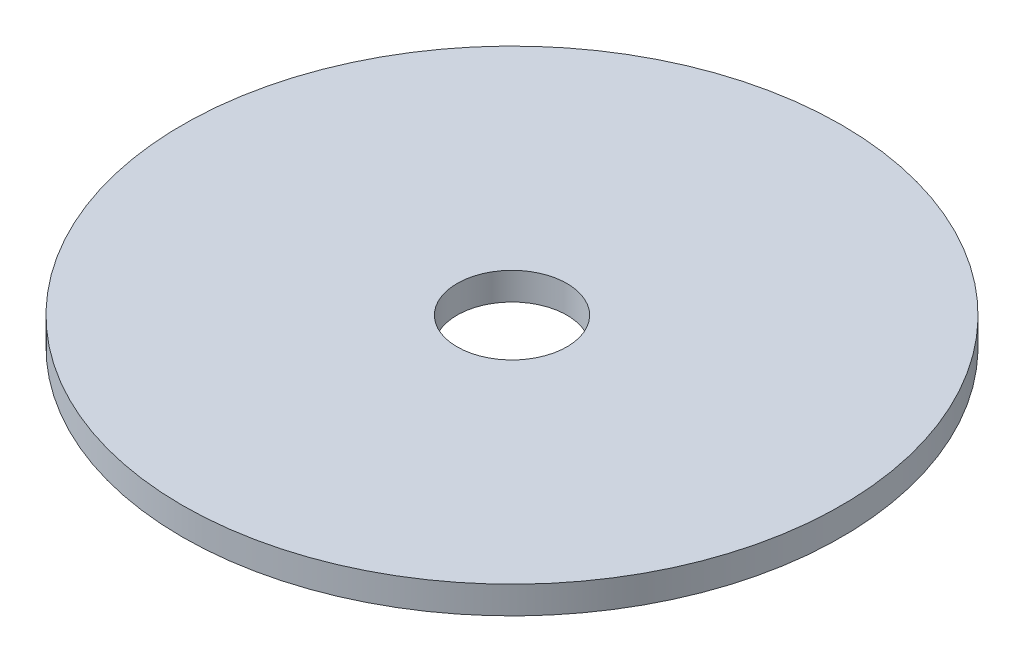
ISO-10303-21;
HEADER;
FILE_DESCRIPTION(('STEP AP214'),'2;1');
FILE_NAME('part.step','',(''),(''),'','','');
FILE_SCHEMA(('AUTOMOTIVE_DESIGN { 1 0 10303 214 1 1 1 1 }'));
ENDSEC;
DATA;
#1=APPLICATION_CONTEXT('core data for automotive mechanical design processes');
#2=APPLICATION_PROTOCOL_DEFINITION('international standard','automotive_design',2000,#1);
#3=PRODUCT_CONTEXT('',#1,'mechanical');
#4=PRODUCT('Part','Part','',(#3));
#5=PRODUCT_RELATED_PRODUCT_CATEGORY('part','',(#4));
#6=PRODUCT_DEFINITION_FORMATION('','',#4);
#7=PRODUCT_DEFINITION_CONTEXT('part definition',#1,'design');
#8=PRODUCT_DEFINITION('design','',#6,#7);
#9=PRODUCT_DEFINITION_SHAPE('','',#8);
#10=(LENGTH_UNIT() NAMED_UNIT(*) SI_UNIT(.MILLI.,.METRE.));
#11=(NAMED_UNIT(*) PLANE_ANGLE_UNIT() SI_UNIT($,.RADIAN.));
#12=(NAMED_UNIT(*) SI_UNIT($,.STERADIAN.) SOLID_ANGLE_UNIT());
#13=UNCERTAINTY_MEASURE_WITH_UNIT(LENGTH_MEASURE(1.E-05),#10,'distance_accuracy_value','');
#14=(GEOMETRIC_REPRESENTATION_CONTEXT(3) GLOBAL_UNCERTAINTY_ASSIGNED_CONTEXT((#13)) GLOBAL_UNIT_ASSIGNED_CONTEXT((#10,
#11,#12)) REPRESENTATION_CONTEXT('',''));
#15=CARTESIAN_POINT('',(0.,0.,0.));
#16=DIRECTION('',(0.,0.,1.));
#17=DIRECTION('',(1.,0.,0.));
#18=AXIS2_PLACEMENT_3D('',#15,#16,#17);
#19=CARTESIAN_POINT('',(0.,2.5,0.));
#20=DIRECTION('',(0.,-1.,0.));
#21=DIRECTION('',(0.,0.,-1.));
#22=AXIS2_PLACEMENT_3D('',#19,#20,#21);
#23=CYLINDRICAL_SURFACE('',#22,30.);
#24=CARTESIAN_POINT('',(0.,2.5,0.));
#25=DIRECTION('',(0.,1.,0.));
#26=DIRECTION('',(0.,0.,1.));
#27=AXIS2_PLACEMENT_3D('',#24,#25,#26);
#28=CIRCLE('',#27,30.);
#29=CARTESIAN_POINT('',(0.,2.5,30.));
#30=VERTEX_POINT('',#29);
#31=EDGE_CURVE('E10',#30,#30,#28,.T.);
#32=ORIENTED_EDGE('',*,*,#31,.F.);
#33=EDGE_LOOP('',(#32));
#34=FACE_BOUND('',#33,.T.);
#35=CARTESIAN_POINT('',(0.,0.,0.));
#36=DIRECTION('',(0.,1.,0.));
#37=DIRECTION('',(0.,0.,1.));
#38=AXIS2_PLACEMENT_3D('',#35,#36,#37);
#39=CIRCLE('',#38,30.);
#40=CARTESIAN_POINT('',(0.,0.,30.));
#41=VERTEX_POINT('',#40);
#42=EDGE_CURVE('E36',#41,#41,#39,.T.);
#43=ORIENTED_EDGE('',*,*,#42,.T.);
#44=EDGE_LOOP('',(#43));
#45=FACE_BOUND('',#44,.T.);
#46=ADVANCED_FACE('F33',(#34,#45),#23,.T.);
#47=CARTESIAN_POINT('',(0.,2.5,0.));
#48=DIRECTION('',(0.,1.,0.));
#49=DIRECTION('',(0.,0.,1.));
#50=AXIS2_PLACEMENT_3D('',#47,#48,#49);
#51=PLANE('',#50);
#52=CARTESIAN_POINT('',(0.,2.5,0.));
#53=DIRECTION('',(0.,1.,0.));
#54=DIRECTION('',(0.,0.,1.));
#55=AXIS2_PLACEMENT_3D('',#52,#53,#54);
#56=CIRCLE('',#55,5.);
#57=CARTESIAN_POINT('',(0.,2.5,5.));
#58=VERTEX_POINT('',#57);
#59=EDGE_CURVE('E45',#58,#58,#56,.T.);
#60=ORIENTED_EDGE('',*,*,#59,.F.);
#61=EDGE_LOOP('',(#60));
#62=FACE_BOUND('',#61,.T.);
#63=ORIENTED_EDGE('',*,*,#31,.T.);
#64=EDGE_LOOP('',(#63));
#65=FACE_BOUND('',#64,.T.);
#66=ADVANCED_FACE('F60',(#62,#65),#51,.T.);
#67=CARTESIAN_POINT('',(0.,0.,0.));
#68=DIRECTION('',(0.,1.,0.));
#69=DIRECTION('',(0.,0.,1.));
#70=AXIS2_PLACEMENT_3D('',#67,#68,#69);
#71=PLANE('',#70);
#72=CARTESIAN_POINT('',(0.,0.,0.));
#73=DIRECTION('',(0.,1.,0.));
#74=DIRECTION('',(0.,0.,1.));
#75=AXIS2_PLACEMENT_3D('',#72,#73,#74);
#76=CIRCLE('',#75,5.);
#77=CARTESIAN_POINT('',(0.,0.,5.));
#78=VERTEX_POINT('',#77);
#79=EDGE_CURVE('E43',#78,#78,#76,.T.);
#80=ORIENTED_EDGE('',*,*,#79,.T.);
#81=EDGE_LOOP('',(#80));
#82=FACE_BOUND('',#81,.T.);
#83=ORIENTED_EDGE('',*,*,#42,.F.);
#84=EDGE_LOOP('',(#83));
#85=FACE_BOUND('',#84,.T.);
#86=ADVANCED_FACE('F51',(#82,#85),#71,.F.);
#87=CARTESIAN_POINT('',(0.,0.,0.));
#88=DIRECTION('',(0.,1.,0.));
#89=DIRECTION('',(0.,0.,1.));
#90=AXIS2_PLACEMENT_3D('',#87,#88,#89);
#91=CYLINDRICAL_SURFACE('',#90,5.);
#92=ORIENTED_EDGE('',*,*,#79,.F.);
#93=EDGE_LOOP('',(#92));
#94=FACE_BOUND('',#93,.T.);
#95=ORIENTED_EDGE('',*,*,#59,.T.);
#96=EDGE_LOOP('',(#95));
#97=FACE_BOUND('',#96,.T.);
#98=ADVANCED_FACE('F54',(#94,#97),#91,.F.);
#99=CLOSED_SHELL('',(#46,#66,#86,#98));
#100=MANIFOLD_SOLID_BREP('B2',#99);
#101=ADVANCED_BREP_SHAPE_REPRESENTATION('',(#18,#100),#14);
#102=SHAPE_DEFINITION_REPRESENTATION(#9,#101);
ENDSEC;
END-ISO-10303-21;
